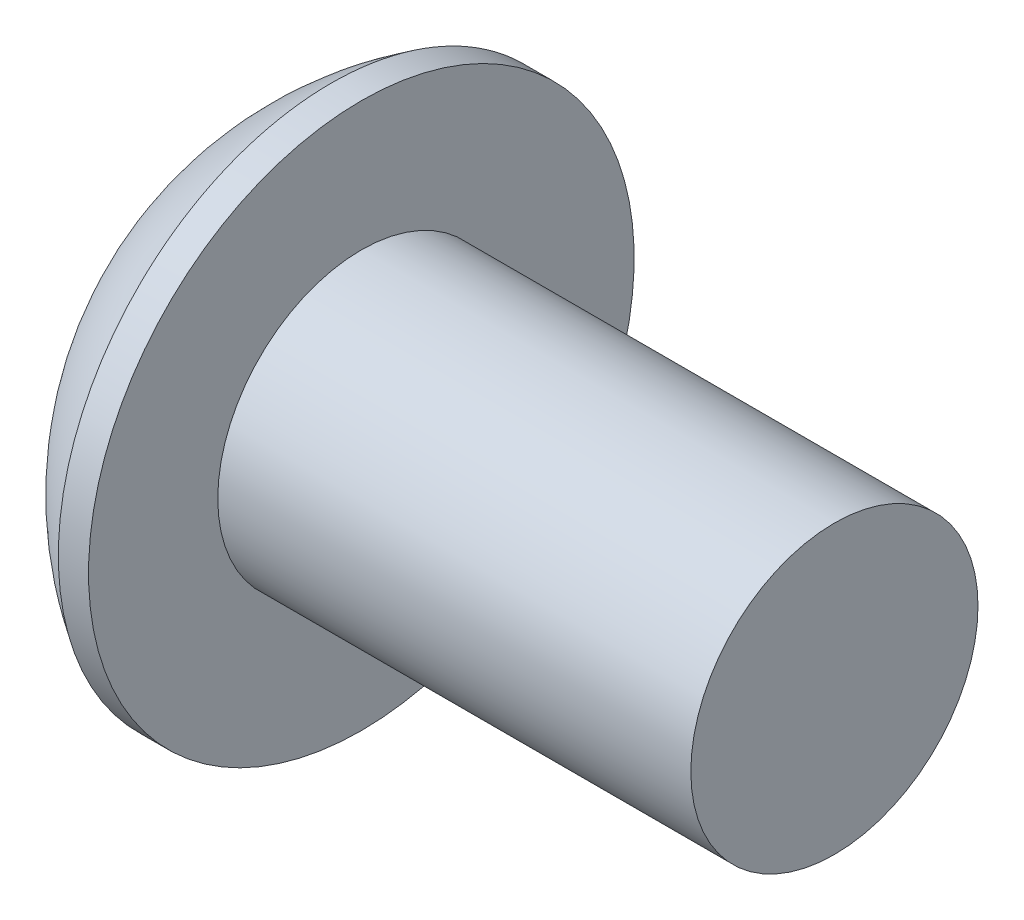
ISO-10303-21;
HEADER;
FILE_DESCRIPTION(('STEP AP214'),'2;1');
FILE_NAME('part.step','',(''),(''),'','','');
FILE_SCHEMA(('AUTOMOTIVE_DESIGN { 1 0 10303 214 1 1 1 1 }'));
ENDSEC;
DATA;
#1=APPLICATION_CONTEXT('core data for automotive mechanical design processes');
#2=APPLICATION_PROTOCOL_DEFINITION('international standard','automotive_design',2000,#1);
#3=PRODUCT_CONTEXT('',#1,'mechanical');
#4=PRODUCT('Part','Part','',(#3));
#5=PRODUCT_RELATED_PRODUCT_CATEGORY('part','',(#4));
#6=PRODUCT_DEFINITION_FORMATION('','',#4);
#7=PRODUCT_DEFINITION_CONTEXT('part definition',#1,'design');
#8=PRODUCT_DEFINITION('design','',#6,#7);
#9=PRODUCT_DEFINITION_SHAPE('','',#8);
#10=(LENGTH_UNIT() NAMED_UNIT(*) SI_UNIT(.MILLI.,.METRE.));
#11=(NAMED_UNIT(*) PLANE_ANGLE_UNIT() SI_UNIT($,.RADIAN.));
#12=(NAMED_UNIT(*) SI_UNIT($,.STERADIAN.) SOLID_ANGLE_UNIT());
#13=UNCERTAINTY_MEASURE_WITH_UNIT(LENGTH_MEASURE(1.E-05),#10,'distance_accuracy_value','');
#14=(GEOMETRIC_REPRESENTATION_CONTEXT(3) GLOBAL_UNCERTAINTY_ASSIGNED_CONTEXT((#13)) GLOBAL_UNIT_ASSIGNED_CONTEXT((#10,
#11,#12)) REPRESENTATION_CONTEXT('',''));
#15=CARTESIAN_POINT('',(0.,0.,0.));
#16=DIRECTION('',(0.,0.,1.));
#17=DIRECTION('',(1.,0.,0.));
#18=AXIS2_PLACEMENT_3D('',#15,#16,#17);
#19=CARTESIAN_POINT('',(-0.533400000000002,0.,0.));
#20=DIRECTION('',(-1.,0.,0.));
#21=DIRECTION('',(0.,0.,1.));
#22=AXIS2_PLACEMENT_3D('',#19,#20,#21);
#23=PLANE('',#22);
#24=DIRECTION('',(0.,0.5,0.866025403784439));
#25=VECTOR('',#24,1.);
#26=CARTESIAN_POINT('',(-0.533400000000002,1.83308710467706,0.));
#27=LINE('',#26,#25);
#28=CARTESIAN_POINT('',(-0.533400000000002,1.83308710467706,0.));
#29=VERTEX_POINT('',#28);
#30=CARTESIAN_POINT('',(-0.533400000000002,0.916543552338531,-1.5875));
#31=VERTEX_POINT('',#30);
#32=EDGE_CURVE('E114',#29,#31,#27,.F.);
#33=ORIENTED_EDGE('',*,*,#32,.T.);
#34=DIRECTION('',(0.,1.,0.));
#35=VECTOR('',#34,1.);
#36=CARTESIAN_POINT('',(-0.533400000000002,0.916543552338531,-1.5875));
#37=LINE('',#36,#35);
#38=CARTESIAN_POINT('',(-0.533400000000002,-0.916543552338531,-1.5875));
#39=VERTEX_POINT('',#38);
#40=EDGE_CURVE('E81',#31,#39,#37,.F.);
#41=ORIENTED_EDGE('',*,*,#40,.T.);
#42=DIRECTION('',(0.,0.5,-0.866025403784439));
#43=VECTOR('',#42,1.);
#44=CARTESIAN_POINT('',(-0.533400000000002,-0.916543552338531,-1.5875));
#45=LINE('',#44,#43);
#46=CARTESIAN_POINT('',(-0.533400000000002,-1.83308710467706,0.));
#47=VERTEX_POINT('',#46);
#48=EDGE_CURVE('E83',#39,#47,#45,.F.);
#49=ORIENTED_EDGE('',*,*,#48,.T.);
#50=DIRECTION('',(0.,-0.5,-0.866025403784439));
#51=VECTOR('',#50,1.);
#52=CARTESIAN_POINT('',(-0.533400000000002,-1.83308710467706,0.));
#53=LINE('',#52,#51);
#54=CARTESIAN_POINT('',(-0.533400000000002,-0.916543552338533,1.5875));
#55=VERTEX_POINT('',#54);
#56=EDGE_CURVE('E84',#47,#55,#53,.F.);
#57=ORIENTED_EDGE('',*,*,#56,.T.);
#58=DIRECTION('',(0.,-1.,0.));
#59=VECTOR('',#58,1.);
#60=CARTESIAN_POINT('',(-0.533400000000002,-0.916543552338532,1.5875));
#61=LINE('',#60,#59);
#62=CARTESIAN_POINT('',(-0.533400000000002,0.916543552338531,1.5875));
#63=VERTEX_POINT('',#62);
#64=EDGE_CURVE('E70',#55,#63,#61,.F.);
#65=ORIENTED_EDGE('',*,*,#64,.T.);
#66=DIRECTION('',(0.,-0.5,0.866025403784439));
#67=VECTOR('',#66,1.);
#68=CARTESIAN_POINT('',(-0.533400000000002,0.916543552338531,1.5875));
#69=LINE('',#68,#67);
#70=EDGE_CURVE('E109',#63,#29,#69,.F.);
#71=ORIENTED_EDGE('',*,*,#70,.T.);
#72=EDGE_LOOP('',(#33,#41,#49,#57,#65,#71));
#73=FACE_BOUND('',#72,.T.);
#74=ADVANCED_FACE('F16',(#73),#23,.T.);
#75=CARTESIAN_POINT('',(-0.533400000000002,-1.83308710467706,0.));
#76=DIRECTION('',(0.,-0.866025403784439,0.5));
#77=DIRECTION('',(0.,-0.5,-0.866025403784439));
#78=AXIS2_PLACEMENT_3D('',#75,#76,#77);
#79=PLANE('',#78);
#80=CARTESIAN_POINT('',(-2.56539999994394,-1.8330871046745,-2.00804498786736E-11));
#81=CARTESIAN_POINT('',(-2.53392818229741,-1.80158505518366,0.0545631502562923));
#82=CARTESIAN_POINT('',(-2.5043050627177,-1.76955629074211,0.110038597579172));
#83=CARTESIAN_POINT('',(-2.45006639539122,-1.70424635317817,0.223158727683824));
#84=CARTESIAN_POINT('',(-2.42548101615987,-1.6709589724711,0.280814162317604));
#85=CARTESIAN_POINT('',(-2.38336609605347,-1.60383660211837,0.397073518091736));
#86=CARTESIAN_POINT('',(-2.36573072948629,-1.57001869730198,0.455647847439699));
#87=CARTESIAN_POINT('',(-2.33856008862263,-1.50163859306838,0.574085662199493));
#88=CARTESIAN_POINT('',(-2.32900454007239,-1.46707848106388,0.633945532106421));
#89=CARTESIAN_POINT('',(-2.32038274183869,-1.40751253669323,0.737116774157155));
#90=CARTESIAN_POINT('',(-2.31910682172836,-1.38258360390154,0.780294952330845));
#91=CARTESIAN_POINT('',(-2.32125913780735,-1.33276652395073,0.866580665890379));
#92=CARTESIAN_POINT('',(-2.32468902284537,-1.30787839414808,0.90968817121394));
#93=CARTESIAN_POINT('',(-2.33605631415915,-1.25834345643267,0.995485200086784));
#94=CARTESIAN_POINT('',(-2.34399762019329,-1.23369687609494,1.03817432946455));
#95=CARTESIAN_POINT('',(-2.36395627681902,-1.18481740842653,1.12283605091316));
#96=CARTESIAN_POINT('',(-2.37597537628367,-1.16058470328902,1.16480832741616));
#97=CARTESIAN_POINT('',(-2.41164383187845,-1.09853862948576,1.27227527965358));
#98=CARTESIAN_POINT('',(-2.43797770752625,-1.06110942924036,1.33710455616529));
#99=CARTESIAN_POINT('',(-2.48243061452926,-1.00607390269188,1.43242888436855));
#100=CARTESIAN_POINT('',(-2.49804835924321,-0.987937988038022,1.46384120999077));
#101=CARTESIAN_POINT('',(-2.53070945051393,-0.951999508520197,1.52608848246242));
#102=CARTESIAN_POINT('',(-2.54775211871235,-0.934196789917587,1.55692369559499));
#103=CARTESIAN_POINT('',(-2.56539999993807,-0.916543552329633,1.58750000001541));
#104=B_SPLINE_CURVE_WITH_KNOTS('',3,(#80,#81,#82,#83,#84,#85,#86,#87,#88,#89,#90,#91,#92,#93,
#94,#95,#96,#97,#98,#99,#100,#101,#102,#103),.UNSPECIFIED.,.F.,.F.,(4,2,2,2,2,2,2,2,2,2,2,4),
(0.,0.211427927732169,0.424087197148228,0.633370156422424,0.842126401515785,0.991537201098734,
1.14100036552056,1.29059292577265,1.44024972414947,1.67781721417335,1.79627069411587,
1.91466809995991),.UNSPECIFIED.);
#105=CARTESIAN_POINT('',(-2.56539999993857,-1.83308710468646,0.));
#106=VERTEX_POINT('',#105);
#107=CARTESIAN_POINT('',(-2.56539999993106,-0.916543552342318,1.5875));
#108=VERTEX_POINT('',#107);
#109=EDGE_CURVE('E19',#106,#108,#104,.T.);
#110=ORIENTED_EDGE('',*,*,#109,.T.);
#111=DIRECTION('',(1.,0.,0.));
#112=VECTOR('',#111,1.);
#113=CARTESIAN_POINT('',(-0.533400000000002,-0.916543552338533,1.5875));
#114=LINE('',#113,#112);
#115=EDGE_CURVE('E89',#108,#55,#114,.T.);
#116=ORIENTED_EDGE('',*,*,#115,.T.);
#117=ORIENTED_EDGE('',*,*,#56,.F.);
#118=DIRECTION('',(1.,0.,0.));
#119=VECTOR('',#118,1.);
#120=CARTESIAN_POINT('',(-0.533400000000002,-1.83308710467706,0.));
#121=LINE('',#120,#119);
#122=EDGE_CURVE('E57',#47,#106,#121,.F.);
#123=ORIENTED_EDGE('',*,*,#122,.T.);
#124=EDGE_LOOP('',(#110,#116,#117,#123));
#125=FACE_BOUND('',#124,.T.);
#126=ADVANCED_FACE('F88',(#125),#79,.F.);
#127=CARTESIAN_POINT('',(-0.533400000000002,-0.916543552338531,-1.5875));
#128=DIRECTION('',(0.,-0.866025403784439,-0.5));
#129=DIRECTION('',(0.,0.5,-0.866025403784439));
#130=AXIS2_PLACEMENT_3D('',#127,#128,#129);
#131=PLANE('',#130);
#132=CARTESIAN_POINT('',(-2.56539999994527,-0.916543552319403,-1.58750000001409));
#133=CARTESIAN_POINT('',(-2.53392818229919,-0.948045601822691,-1.53293684974403));
#134=CARTESIAN_POINT('',(-2.50430506271949,-0.980074366269487,-1.47746140242354));
#135=CARTESIAN_POINT('',(-2.45006639539264,-1.04538430383757,-1.36434127232016));
#136=CARTESIAN_POINT('',(-2.42548101616093,-1.07867168454351,-1.30668583768523));
#137=CARTESIAN_POINT('',(-2.38336609605398,-1.14579405489574,-1.19042648190974));
#138=CARTESIAN_POINT('',(-2.36573072948662,-1.17961195971273,-1.13185215256154));
#139=CARTESIAN_POINT('',(-2.3385600886227,-1.2479920639471,-1.013414337801));
#140=CARTESIAN_POINT('',(-2.32900454007237,-1.28255217595175,-0.953554467893575));
#141=CARTESIAN_POINT('',(-2.32038274183866,-1.34211812032265,-0.850383225842316));
#142=CARTESIAN_POINT('',(-2.31910682172835,-1.36704705311438,-0.807205047668587));
#143=CARTESIAN_POINT('',(-2.32125913780739,-1.41686413306525,-0.720919334108961));
#144=CARTESIAN_POINT('',(-2.32468902284544,-1.44175226286793,-0.67781182878535));
#145=CARTESIAN_POINT('',(-2.33605631415929,-1.49128720058339,-0.592014799912417));
#146=CARTESIAN_POINT('',(-2.34399762019345,-1.51593378092113,-0.54932567053461));
#147=CARTESIAN_POINT('',(-2.36395627681926,-1.56481324858959,-0.464663949085931));
#148=CARTESIAN_POINT('',(-2.37597537628395,-1.58904595372712,-0.422691672582891));
#149=CARTESIAN_POINT('',(-2.41164383187876,-1.65109202753029,-0.315224720345625));
#150=CARTESIAN_POINT('',(-2.43797770752652,-1.6885212277756,-0.250395443834082));
#151=CARTESIAN_POINT('',(-2.48243061452944,-1.74355675432393,-0.15507111563107));
#152=CARTESIAN_POINT('',(-2.49804835924337,-1.76169266897775,-0.123658790008927));
#153=CARTESIAN_POINT('',(-2.53070945051401,-1.79763114849548,-0.0614115175374324));
#154=CARTESIAN_POINT('',(-2.5477521187124,-1.81543386709805,-0.0305763044049344));
#155=CARTESIAN_POINT('',(-2.56539999993807,-1.83308710468596,1.54136844652939E-11));
#156=B_SPLINE_CURVE_WITH_KNOTS('',3,(#132,#133,#134,#135,#136,#137,#138,#139,#140,#141,#142,
#143,#144,#145,#146,#147,#148,#149,#150,#151,#152,#153,#154,#155),.UNSPECIFIED.,.F.,.F.,(4,2,2,
2,2,2,2,2,2,2,2,4),(0.,0.211427927733669,0.424087197151313,0.633370156427101,0.842126401522016,
0.99153720110513,1.14100036552713,1.29059292577937,1.44024972415633,1.67781721417961,
1.79627069412184,1.9146680999656),.UNSPECIFIED.);
#157=CARTESIAN_POINT('',(-2.56539999995198,-0.916543552351339,-1.58750000002218));
#158=VERTEX_POINT('',#157);
#159=EDGE_CURVE('E93',#158,#106,#156,.T.);
#160=ORIENTED_EDGE('',*,*,#159,.T.);
#161=ORIENTED_EDGE('',*,*,#122,.F.);
#162=ORIENTED_EDGE('',*,*,#48,.F.);
#163=DIRECTION('',(-1.,0.,0.));
#164=VECTOR('',#163,1.);
#165=CARTESIAN_POINT('',(-0.533400000000002,-0.916543552338531,-1.5875));
#166=LINE('',#165,#164);
#167=EDGE_CURVE('E95',#39,#158,#166,.T.);
#168=ORIENTED_EDGE('',*,*,#167,.T.);
#169=EDGE_LOOP('',(#160,#161,#162,#168));
#170=FACE_BOUND('',#169,.T.);
#171=ADVANCED_FACE('F91',(#170),#131,.F.);
#172=CARTESIAN_POINT('',(-0.533400000000002,0.916543552338531,-1.5875));
#173=DIRECTION('',(0.,0.,-1.));
#174=DIRECTION('',(-1.,0.,0.));
#175=AXIS2_PLACEMENT_3D('',#172,#173,#174);
#176=PLANE('',#175);
#177=CARTESIAN_POINT('',(-2.56539999994527,0.916543552360294,-1.58749999999048));
#178=CARTESIAN_POINT('',(-2.53392818229821,0.853539453376781,-1.58749999999657));
#179=CARTESIAN_POINT('',(-2.50430506271702,0.789481924500113,-1.58749999999908));
#180=CARTESIAN_POINT('',(-2.45006639538581,0.658862049392287,-1.58750000000093));
#181=CARTESIAN_POINT('',(-2.42548101615122,0.59228728799181,-1.58750000000025));
#182=CARTESIAN_POINT('',(-2.38336609603683,0.458042547310979,-1.58749999999976));
#183=CARTESIAN_POINT('',(-2.36573072946494,0.390406737689213,-1.58749999999994));
#184=CARTESIAN_POINT('',(-2.3385600885904,0.253646529243895,-1.58750000000006));
#185=CARTESIAN_POINT('',(-2.32900454003397,0.184526305245804,-1.58750000000001));
#186=CARTESIAN_POINT('',(-2.32038274178942,0.0653944165301613,-1.58749999999999));
#187=CARTESIAN_POINT('',(-2.31910682167392,0.0155365509618711,-1.5875));
#188=CARTESIAN_POINT('',(-2.3212591377409,-0.0840976089101244,-1.5875));
#189=CARTESIAN_POINT('',(-2.32468902277208,-0.133873868500894,-1.5875));
#190=CARTESIAN_POINT('',(-2.33605631407098,-0.2329437439033,-1.5875));
#191=CARTESIAN_POINT('',(-2.34399762009707,-0.282236904564879,-1.5875));
#192=CARTESIAN_POINT('',(-2.36395627670599,-0.379995839874564,-1.5875));
#193=CARTESIAN_POINT('',(-2.37597537616188,-0.428461250136325,-1.5875));
#194=CARTESIAN_POINT('',(-2.41164383175616,-0.552553397787632,-1.5875));
#195=CARTESIAN_POINT('',(-2.43797770742117,-0.627411798334259,-1.5875));
#196=CARTESIAN_POINT('',(-2.48243061445881,-0.737482851511091,-1.5875));
#197=CARTESIAN_POINT('',(-2.49804835918582,-0.773754680844889,-1.5875));
#198=CARTESIAN_POINT('',(-2.53070945048496,-0.845631639931401,-1.5875));
#199=CARTESIAN_POINT('',(-2.54775211869874,-0.881237077161412,-1.5875));
#200=CARTESIAN_POINT('',(-2.56539999994071,-0.916543552361606,-1.5875));
#201=B_SPLINE_CURVE_WITH_KNOTS('',3,(#177,#178,#179,#180,#181,#182,#183,#184,#185,#186,#187,
#188,#189,#190,#191,#192,#193,#194,#195,#196,#197,#198,#199,#200),.UNSPECIFIED.,.F.,.F.,(4,2,2,
2,2,2,2,2,2,2,2,4),(0.,0.211427927701375,0.424087197086717,0.633370156331471,0.842126401395377,
0.991537200933545,1.14100036531054,1.29059292551773,1.44024972384963,1.677817214047,
1.79627069407681,1.91466810000777),.UNSPECIFIED.);
#202=CARTESIAN_POINT('',(-2.56539999995198,0.916543552337129,-1.58749999999757));
#203=VERTEX_POINT('',#202);
#204=EDGE_CURVE('E197',#203,#158,#201,.T.);
#205=ORIENTED_EDGE('',*,*,#204,.T.);
#206=ORIENTED_EDGE('',*,*,#167,.F.);
#207=ORIENTED_EDGE('',*,*,#40,.F.);
#208=DIRECTION('',(1.,0.,0.));
#209=VECTOR('',#208,1.);
#210=CARTESIAN_POINT('',(-0.533400000000002,0.916543552338531,-1.5875));
#211=LINE('',#210,#209);
#212=EDGE_CURVE('E111',#31,#203,#211,.F.);
#213=ORIENTED_EDGE('',*,*,#212,.T.);
#214=EDGE_LOOP('',(#205,#206,#207,#213));
#215=FACE_BOUND('',#214,.T.);
#216=ADVANCED_FACE('F187',(#215),#176,.F.);
#217=CARTESIAN_POINT('',(-0.533400000000002,1.83308710467706,0.));
#218=DIRECTION('',(0.,0.866025403784439,-0.5));
#219=DIRECTION('',(0.,0.5,0.866025403784439));
#220=AXIS2_PLACEMENT_3D('',#217,#218,#219);
#221=PLANE('',#220);
#222=CARTESIAN_POINT('',(-2.56539999994394,1.8330871046745,2.00800374309997E-11));
#223=CARTESIAN_POINT('',(-2.5339281822974,1.80158505518366,-0.0545631502562965));
#224=CARTESIAN_POINT('',(-2.5043050627177,1.76955629074211,-0.11003859757918));
#225=CARTESIAN_POINT('',(-2.45006639539121,1.70424635317816,-0.22315872768384));
#226=CARTESIAN_POINT('',(-2.42548101615987,1.67095897247109,-0.280814162317626));
#227=CARTESIAN_POINT('',(-2.38336609605347,1.60383660211835,-0.397073518091758));
#228=CARTESIAN_POINT('',(-2.36573072948628,1.57001869730197,-0.455647847439717));
#229=CARTESIAN_POINT('',(-2.33856008862263,1.50163859306837,-0.574085662199503));
#230=CARTESIAN_POINT('',(-2.32900454007239,1.46707848106388,-0.633945532106426));
#231=CARTESIAN_POINT('',(-2.32038274183869,1.40751253669322,-0.737116774157154));
#232=CARTESIAN_POINT('',(-2.31910682172836,1.38258360390154,-0.780294952330843));
#233=CARTESIAN_POINT('',(-2.32125913780735,1.33276652395073,-0.866580665890374));
#234=CARTESIAN_POINT('',(-2.32468902284537,1.30787839414808,-0.909688171213933));
#235=CARTESIAN_POINT('',(-2.33605631415915,1.25834345643267,-0.995485200086777));
#236=CARTESIAN_POINT('',(-2.34399762019328,1.23369687609495,-1.03817432946455));
#237=CARTESIAN_POINT('',(-2.36395627681902,1.18481740842653,-1.12283605091316));
#238=CARTESIAN_POINT('',(-2.37597537628367,1.16058470328902,-1.16480832741616));
#239=CARTESIAN_POINT('',(-2.41164383187872,1.09853862948529,-1.2722752796544));
#240=CARTESIAN_POINT('',(-2.43797770752691,1.06110942923942,-1.33710455616691));
#241=CARTESIAN_POINT('',(-2.48243061453059,1.00607390269029,-1.43242888437131));
#242=CARTESIAN_POINT('',(-2.49804835924479,0.987937988036214,-1.4638412099939));
#243=CARTESIAN_POINT('',(-2.53070945051602,0.951999508517968,-1.52608848246628));
#244=CARTESIAN_POINT('',(-2.54775211871471,0.934196789915152,-1.55692369559921));
#245=CARTESIAN_POINT('',(-2.56539999994071,0.916543552326994,-1.58750000001998));
#246=B_SPLINE_CURVE_WITH_KNOTS('',3,(#222,#223,#224,#225,#226,#227,#228,#229,#230,#231,#232,
#233,#234,#235,#236,#237,#238,#239,#240,#241,#242,#243,#244,#245),.UNSPECIFIED.,.F.,.F.,(4,2,2,
2,2,2,2,2,2,2,2,4),(0.,0.211427927732185,0.424087197148259,0.63337015642244,0.842126401515786,
0.99153720109873,1.14100036552055,1.29059292577265,1.44024972414947,1.67781721417631,
1.7962706941203,1.9146680999658),.UNSPECIFIED.);
#247=CARTESIAN_POINT('',(-2.56539999993857,1.83308710468646,0.));
#248=VERTEX_POINT('',#247);
#249=EDGE_CURVE('E191',#248,#203,#246,.T.);
#250=ORIENTED_EDGE('',*,*,#249,.T.);
#251=ORIENTED_EDGE('',*,*,#212,.F.);
#252=ORIENTED_EDGE('',*,*,#32,.F.);
#253=DIRECTION('',(1.,0.,0.));
#254=VECTOR('',#253,1.);
#255=CARTESIAN_POINT('',(-0.533400000000002,1.83308710467706,0.));
#256=LINE('',#255,#254);
#257=EDGE_CURVE('E106',#29,#248,#256,.F.);
#258=ORIENTED_EDGE('',*,*,#257,.T.);
#259=EDGE_LOOP('',(#250,#251,#252,#258));
#260=FACE_BOUND('',#259,.T.);
#261=ADVANCED_FACE('F183',(#260),#221,.F.);
#262=CARTESIAN_POINT('',(-0.533400000000002,0.916543552338531,1.5875));
#263=DIRECTION('',(0.,0.866025403784439,0.5));
#264=DIRECTION('',(0.,-0.5,0.866025403784439));
#265=AXIS2_PLACEMENT_3D('',#262,#263,#264);
#266=PLANE('',#265);
#267=CARTESIAN_POINT('',(-2.56539999994394,0.91654355231986,1.58750000000782));
#268=CARTESIAN_POINT('',(-2.53392818229741,0.948045601824288,1.5329368497393));
#269=CARTESIAN_POINT('',(-2.5043050627177,0.980074366271431,1.47746140241964));
#270=CARTESIAN_POINT('',(-2.45006639539122,1.04538430383949,1.36434127231737));
#271=CARTESIAN_POINT('',(-2.42548101615987,1.07867168454504,1.30668583768271));
#272=CARTESIAN_POINT('',(-2.38336609605347,1.14579405489669,1.19042648190795));
#273=CARTESIAN_POINT('',(-2.36573072948629,1.17961195971347,1.13185215256022));
#274=CARTESIAN_POINT('',(-2.33856008862263,1.24799206394736,1.01341433780059));
#275=CARTESIAN_POINT('',(-2.32900454007239,1.28255217595174,0.953554467893597));
#276=CARTESIAN_POINT('',(-2.32038274183869,1.34211812032234,0.850383225842832));
#277=CARTESIAN_POINT('',(-2.31910682172836,1.36704705311405,0.807205047669152));
#278=CARTESIAN_POINT('',(-2.32125913780735,1.41686413306487,0.720919334109624));
#279=CARTESIAN_POINT('',(-2.32468902284537,1.44175226286752,0.677811828786061));
#280=CARTESIAN_POINT('',(-2.33605631415915,1.49128720058292,0.592014799913215));
#281=CARTESIAN_POINT('',(-2.34399762019328,1.51593378092065,0.549325670535446));
#282=CARTESIAN_POINT('',(-2.36395627681902,1.56481324858906,0.464663949086841));
#283=CARTESIAN_POINT('',(-2.37597537628367,1.58904595372657,0.422691672583837));
#284=CARTESIAN_POINT('',(-2.41164383187845,1.65109202752983,0.315224720346425));
#285=CARTESIAN_POINT('',(-2.43797770752625,1.68852122777524,0.250395443834706));
#286=CARTESIAN_POINT('',(-2.48243061452926,1.74355675432371,0.155071115631445));
#287=CARTESIAN_POINT('',(-2.49804835924321,1.76169266897757,0.123658790009225));
#288=CARTESIAN_POINT('',(-2.53070945051393,1.7976311484954,0.0614115175375789));
#289=CARTESIAN_POINT('',(-2.54775211871235,1.81543386709801,0.0305763044050067));
#290=CARTESIAN_POINT('',(-2.56539999993807,1.83308710468596,-1.54142580803093E-11));
#291=B_SPLINE_CURVE_WITH_KNOTS('',3,(#267,#268,#269,#270,#271,#272,#273,#274,#275,#276,#277,
#278,#279,#280,#281,#282,#283,#284,#285,#286,#287,#288,#289,#290),.UNSPECIFIED.,.F.,.F.,(4,2,2,
2,2,2,2,2,2,2,2,4),(0.,0.211427927732169,0.424087197148227,0.633370156422423,0.842126401515785,
0.991537201098733,1.14100036552056,1.29059292577265,1.44024972414946,1.67781721417335,
1.79627069411587,1.91466809995991),.UNSPECIFIED.);
#292=CARTESIAN_POINT('',(-2.56539999993857,0.91654355234323,1.58750000000814));
#293=VERTEX_POINT('',#292);
#294=EDGE_CURVE('E165',#293,#248,#291,.T.);
#295=ORIENTED_EDGE('',*,*,#294,.T.);
#296=ORIENTED_EDGE('',*,*,#257,.F.);
#297=ORIENTED_EDGE('',*,*,#70,.F.);
#298=DIRECTION('',(1.,0.,0.));
#299=VECTOR('',#298,1.);
#300=CARTESIAN_POINT('',(-0.533400000000002,0.916543552338531,1.5875));
#301=LINE('',#300,#299);
#302=EDGE_CURVE('E38',#63,#293,#301,.F.);
#303=ORIENTED_EDGE('',*,*,#302,.T.);
#304=EDGE_LOOP('',(#295,#296,#297,#303));
#305=FACE_BOUND('',#304,.T.);
#306=ADVANCED_FACE('F176',(#305),#266,.F.);
#307=CARTESIAN_POINT('',(-0.533400000000002,-0.916543552338532,1.5875));
#308=DIRECTION('',(0.,0.,1.));
#309=DIRECTION('',(0.,-1.,0.));
#310=AXIS2_PLACEMENT_3D('',#307,#308,#309);
#311=PLANE('',#310);
#312=CARTESIAN_POINT('',(-2.56539999994394,-0.916543552354642,1.58749999998774));
#313=CARTESIAN_POINT('',(-2.53392818229741,-0.853539453359365,1.58749999999559));
#314=CARTESIAN_POINT('',(-2.50430506271771,-0.789481924470656,1.58749999999882));
#315=CARTESIAN_POINT('',(-2.45006639539122,-0.658862049338629,1.58750000000119));
#316=CARTESIAN_POINT('',(-2.42548101615988,-0.592287287925995,1.58750000000032));
#317=CARTESIAN_POINT('',(-2.38336609605349,-0.458042547221593,1.58749999999969));
#318=CARTESIAN_POINT('',(-2.36573072948631,-0.390406737588416,1.58749999999992));
#319=CARTESIAN_POINT('',(-2.33856008862266,-0.253646529120892,1.58750000000008));
#320=CARTESIAN_POINT('',(-2.32900454007243,-0.184526305112002,1.58750000000002));
#321=CARTESIAN_POINT('',(-2.32038274183874,-0.065394416370719,1.58749999999999));
#322=CARTESIAN_POINT('',(-2.31910682172841,-0.0155365507873145,1.5875));
#323=CARTESIAN_POINT('',(-2.32125913780742,0.0840976091143436,1.5875));
#324=CARTESIAN_POINT('',(-2.32468902284545,0.133873868719661,1.5875));
#325=CARTESIAN_POINT('',(-2.33605631415924,0.232943744150505,1.5875));
#326=CARTESIAN_POINT('',(-2.34399762019338,0.282236904825971,1.5875));
#327=CARTESIAN_POINT('',(-2.36395627681913,0.379995840162817,1.5875));
#328=CARTESIAN_POINT('',(-2.37597537628379,0.428461250437852,1.5875));
#329=CARTESIAN_POINT('',(-2.41164383187857,0.552553398044325,1.5875));
#330=CARTESIAN_POINT('',(-2.43797770752636,0.627411798535089,1.5875));
#331=CARTESIAN_POINT('',(-2.48243061452933,0.737482851631955,1.5875));
#332=CARTESIAN_POINT('',(-2.49804835924327,0.773754680939651,1.5875));
#333=CARTESIAN_POINT('',(-2.53070945051396,0.84563163997525,1.5875));
#334=CARTESIAN_POINT('',(-2.54775211871237,0.881237077180446,1.5875));
#335=CARTESIAN_POINT('',(-2.56539999993807,0.91654355235633,1.5875));
#336=B_SPLINE_CURVE_WITH_KNOTS('',3,(#312,#313,#314,#315,#316,#317,#318,#319,#320,#321,#322,
#323,#324,#325,#326,#327,#328,#329,#330,#331,#332,#333,#334,#335),.UNSPECIFIED.,.F.,.F.,(4,2,2,
2,2,2,2,2,2,2,2,4),(0.,0.211427927732202,0.424087197148294,0.633370156422521,0.842126401515914,
0.991537201098908,1.14100036552078,1.29059292577292,1.44024972414978,1.67781721417349,
1.79627069411592,1.91466809995988),.UNSPECIFIED.);
#337=EDGE_CURVE('E157',#108,#293,#336,.T.);
#338=ORIENTED_EDGE('',*,*,#337,.T.);
#339=ORIENTED_EDGE('',*,*,#302,.F.);
#340=ORIENTED_EDGE('',*,*,#64,.F.);
#341=ORIENTED_EDGE('',*,*,#115,.F.);
#342=EDGE_LOOP('',(#338,#339,#340,#341));
#343=FACE_BOUND('',#342,.T.);
#344=ADVANCED_FACE('F172',(#343),#311,.F.);
#345=CARTESIAN_POINT('',(-2.56540000003724,0.,0.));
#346=DIRECTION('',(-1.,0.,0.));
#347=DIRECTION('',(0.,-1.,0.));
#348=AXIS2_PLACEMENT_3D('',#345,#346,#347);
#349=CONICAL_SURFACE('',#348,1.83308710478514,0.78539816351237);
#350=ORIENTED_EDGE('',*,*,#109,.F.);
#351=CARTESIAN_POINT('',(-2.56539999992356,0.,0.));
#352=DIRECTION('',(-1.,0.,0.));
#353=DIRECTION('',(0.,-1.,0.));
#354=AXIS2_PLACEMENT_3D('',#351,#352,#353);
#355=CIRCLE('',#354,1.83308710467145);
#356=EDGE_CURVE('E164',#108,#106,#355,.F.);
#357=ORIENTED_EDGE('',*,*,#356,.F.);
#358=EDGE_LOOP('',(#350,#357));
#359=FACE_BOUND('',#358,.T.);
#360=ADVANCED_FACE('F175',(#359),#349,.F.);
#361=CARTESIAN_POINT('',(-2.56540000003724,0.,0.));
#362=DIRECTION('',(-1.,0.,0.));
#363=DIRECTION('',(0.,-1.,0.));
#364=AXIS2_PLACEMENT_3D('',#361,#362,#363);
#365=CONICAL_SURFACE('',#364,1.83308710478514,0.78539816351237);
#366=ORIENTED_EDGE('',*,*,#159,.F.);
#367=CARTESIAN_POINT('',(-2.56539999992356,0.,0.));
#368=DIRECTION('',(-1.,0.,0.));
#369=DIRECTION('',(0.,-1.,0.));
#370=AXIS2_PLACEMENT_3D('',#367,#368,#369);
#371=CIRCLE('',#370,1.83308710467145);
#372=EDGE_CURVE('E271',#106,#158,#371,.F.);
#373=ORIENTED_EDGE('',*,*,#372,.F.);
#374=EDGE_LOOP('',(#366,#373));
#375=FACE_BOUND('',#374,.T.);
#376=ADVANCED_FACE('F209',(#375),#365,.F.);
#377=CARTESIAN_POINT('',(-2.56540000003724,0.,0.));
#378=DIRECTION('',(-1.,0.,0.));
#379=DIRECTION('',(0.,-1.,0.));
#380=AXIS2_PLACEMENT_3D('',#377,#378,#379);
#381=CONICAL_SURFACE('',#380,1.83308710478514,0.785398163397448);
#382=ORIENTED_EDGE('',*,*,#204,.F.);
#383=CARTESIAN_POINT('',(-2.5653999999804,0.,0.));
#384=DIRECTION('',(-1.,0.,0.));
#385=DIRECTION('',(0.,-1.,0.));
#386=AXIS2_PLACEMENT_3D('',#383,#384,#385);
#387=CIRCLE('',#386,1.83308710472829);
#388=EDGE_CURVE('E268',#158,#203,#387,.F.);
#389=ORIENTED_EDGE('',*,*,#388,.F.);
#390=EDGE_LOOP('',(#382,#389));
#391=FACE_BOUND('',#390,.T.);
#392=ADVANCED_FACE('F205',(#391),#381,.F.);
#393=CARTESIAN_POINT('',(-2.56540000003724,0.,0.));
#394=DIRECTION('',(-1.,0.,0.));
#395=DIRECTION('',(0.,-1.,0.));
#396=AXIS2_PLACEMENT_3D('',#393,#394,#395);
#397=CONICAL_SURFACE('',#396,1.83308710478514,0.78539816351237);
#398=ORIENTED_EDGE('',*,*,#249,.F.);
#399=CARTESIAN_POINT('',(-2.56539999992356,0.,0.));
#400=DIRECTION('',(-1.,0.,0.));
#401=DIRECTION('',(0.,-1.,0.));
#402=AXIS2_PLACEMENT_3D('',#399,#400,#401);
#403=CIRCLE('',#402,1.83308710467145);
#404=EDGE_CURVE('E265',#203,#248,#403,.F.);
#405=ORIENTED_EDGE('',*,*,#404,.F.);
#406=EDGE_LOOP('',(#398,#405));
#407=FACE_BOUND('',#406,.T.);
#408=ADVANCED_FACE('F202',(#407),#397,.F.);
#409=CARTESIAN_POINT('',(-2.56540000003724,0.,0.));
#410=DIRECTION('',(-1.,0.,0.));
#411=DIRECTION('',(0.,-1.,0.));
#412=AXIS2_PLACEMENT_3D('',#409,#410,#411);
#413=CONICAL_SURFACE('',#412,1.83308710478514,0.78539816351237);
#414=ORIENTED_EDGE('',*,*,#294,.F.);
#415=CARTESIAN_POINT('',(-2.56539999992356,0.,0.));
#416=DIRECTION('',(-1.,0.,0.));
#417=DIRECTION('',(0.,-1.,0.));
#418=AXIS2_PLACEMENT_3D('',#415,#416,#417);
#419=CIRCLE('',#418,1.83308710467145);
#420=EDGE_CURVE('E260',#248,#293,#419,.F.);
#421=ORIENTED_EDGE('',*,*,#420,.F.);
#422=EDGE_LOOP('',(#414,#421));
#423=FACE_BOUND('',#422,.T.);
#424=ADVANCED_FACE('F152',(#423),#413,.F.);
#425=CARTESIAN_POINT('',(-2.56540000003724,0.,0.));
#426=DIRECTION('',(-1.,0.,0.));
#427=DIRECTION('',(0.,-1.,0.));
#428=AXIS2_PLACEMENT_3D('',#425,#426,#427);
#429=CONICAL_SURFACE('',#428,1.83308710478514,0.785398163512485);
#430=ORIENTED_EDGE('',*,*,#337,.F.);
#431=CARTESIAN_POINT('',(-2.56539999992356,0.,0.));
#432=DIRECTION('',(-1.,0.,0.));
#433=DIRECTION('',(0.,-1.,0.));
#434=AXIS2_PLACEMENT_3D('',#431,#432,#433);
#435=CIRCLE('',#434,1.83308710467145);
#436=EDGE_CURVE('E137',#293,#108,#435,.F.);
#437=ORIENTED_EDGE('',*,*,#436,.F.);
#438=EDGE_LOOP('',(#430,#437));
#439=FACE_BOUND('',#438,.T.);
#440=ADVANCED_FACE('F147',(#439),#429,.F.);
#441=CARTESIAN_POINT('',(-2.5654,0.,0.));
#442=DIRECTION('',(-1.,0.,0.));
#443=DIRECTION('',(0.,-1.,0.));
#444=AXIS2_PLACEMENT_3D('',#441,#442,#443);
#445=PLANE('',#444);
#446=CARTESIAN_POINT('',(-2.5654,-2.29235000000002,0.));
#447=CARTESIAN_POINT('',(-2.56540000000001,-2.29234961429958,-0.0643619991867162));
#448=CARTESIAN_POINT('',(-2.56540000000002,-2.28963695190109,-0.128735826629366));
#449=CARTESIAN_POINT('',(-2.56539999999999,-2.27880393843649,-0.257038618985287));
#450=CARTESIAN_POINT('',(-2.56539999999995,-2.27068199085128,-0.320967446929163));
#451=CARTESIAN_POINT('',(-2.56540000000006,-2.24906694794257,-0.448021254607718));
#452=CARTESIAN_POINT('',(-2.56540000000021,-2.23556532653462,-0.511144793381861));
#453=CARTESIAN_POINT('',(-2.56539999999979,-2.20328400495645,-0.636065176149322));
#454=CARTESIAN_POINT('',(-2.56539999999921,-2.18450002159115,-0.697860899533935));
#455=CARTESIAN_POINT('',(-2.56539999999869,-2.12048422735804,-0.88032980292775));
#456=CARTESIAN_POINT('',(-2.56539999999995,-2.0675359907946,-0.99839179592812));
#457=CARTESIAN_POINT('',(-2.56540000000006,-1.94254204858674,-1.22393765942148));
#458=CARTESIAN_POINT('',(-2.56539999999891,-1.87049561696644,-1.33142112758208));
#459=CARTESIAN_POINT('',(-2.56539999999932,-1.74974254194881,-1.48237719670935));
#460=CARTESIAN_POINT('',(-2.56539999999982,-1.70734573132302,-1.53101280076738));
#461=CARTESIAN_POINT('',(-2.56540000000018,-1.6186391029153,-1.62450601319185));
#462=CARTESIAN_POINT('',(-2.56540000000005,-1.57233309727313,-1.66936721890417));
#463=CARTESIAN_POINT('',(-2.56539999999995,-1.47608431707234,-1.7550488420402));
#464=CARTESIAN_POINT('',(-2.56539999999999,-1.42613990458995,-1.79586741981512));
#465=CARTESIAN_POINT('',(-2.56540000000002,-1.32299452541252,-1.87315615311523));
#466=CARTESIAN_POINT('',(-2.56540000000001,-1.26979280714188,-1.90962529930697));
#467=CARTESIAN_POINT('',(-2.56539999999999,-1.10588180153953,-2.0120772215109));
#468=CARTESIAN_POINT('',(-2.5654,-0.990764947001321,-2.07119486286667));
#469=CARTESIAN_POINT('',(-2.5654,-0.752302198839727,-2.16922858468856));
#470=CARTESIAN_POINT('',(-2.5654,-0.628956393121269,-2.2081448809145));
#471=CARTESIAN_POINT('',(-2.5654,-0.377466101733277,-2.2647275576592));
#472=CARTESIAN_POINT('',(-2.5654,-0.249321590440388,-2.28239382469379));
#473=CARTESIAN_POINT('',(-2.5654,0.0081143537161001,-2.29595665980956));
#474=CARTESIAN_POINT('',(-2.5654,0.137405786579698,-2.29185322789073));
#475=CARTESIAN_POINT('',(-2.5654,0.393449386933719,-2.2620096240906));
#476=CARTESIAN_POINT('',(-2.5654,0.520201567981077,-2.23626956775766));
#477=CARTESIAN_POINT('',(-2.5654,0.767645294384444,-2.16383549332687));
#478=CARTESIAN_POINT('',(-2.5654,0.888336774993549,-2.11714125142686));
#479=CARTESIAN_POINT('',(-2.5654,1.06210572146655,-2.03247976453654));
#480=CARTESIAN_POINT('',(-2.5654,1.11884498714066,-2.00180278323696));
#481=CARTESIAN_POINT('',(-2.5654,1.22954062855572,-1.93578011658036));
#482=CARTESIAN_POINT('',(-2.5654,1.28349764565392,-1.9004355139425));
#483=CARTESIAN_POINT('',(-2.5654,1.38821676641537,-1.82534174602348));
#484=CARTESIAN_POINT('',(-2.5654,1.43898030563028,-1.78559458231503));
#485=CARTESIAN_POINT('',(-2.5654,1.53701984534431,-1.70193996292362));
#486=CARTESIAN_POINT('',(-2.5654,1.5842924328055,-1.65802852924127));
#487=CARTESIAN_POINT('',(-2.5654,1.72023903553758,-1.52059650554139));
#488=CARTESIAN_POINT('',(-2.5654,1.80318066138239,-1.42127847626519));
#489=CARTESIAN_POINT('',(-2.5654,1.95118232345098,-1.21011519784664));
#490=CARTESIAN_POINT('',(-2.5654,2.01624303935584,-1.09827042509272));
#491=CARTESIAN_POINT('',(-2.5654,2.09907772661314,-0.923538238005839));
#492=CARTESIAN_POINT('',(-2.5654,2.12425103063558,-0.864058373981966));
#493=CARTESIAN_POINT('',(-2.5654,2.16947990046565,-0.743221562175601));
#494=CARTESIAN_POINT('',(-2.5654,2.18953960800684,-0.681866178863365));
#495=CARTESIAN_POINT('',(-2.5654,2.22438542051156,-0.557786972400356));
#496=CARTESIAN_POINT('',(-2.5654,2.23917985294818,-0.495065478128172));
#497=CARTESIAN_POINT('',(-2.5654,2.26343456384453,-0.368611258323514));
#498=CARTESIAN_POINT('',(-2.5654,2.27289641559285,-0.304878836759566));
#499=CARTESIAN_POINT('',(-2.5654,2.28388649696736,-0.200873029360621));
#500=CARTESIAN_POINT('',(-2.5654,2.28705930623293,-0.160766164180096));
#501=CARTESIAN_POINT('',(-2.5654,2.29129117827044,-0.0804410725432706));
#502=CARTESIAN_POINT('',(-2.5654,2.29235024104238,-0.0402228460869715));
#503=CARTESIAN_POINT('',(-2.56540000000001,2.29234961429956,0.0643619991867166));
#504=CARTESIAN_POINT('',(-2.56540000000002,2.28963695190107,0.128735826629366));
#505=CARTESIAN_POINT('',(-2.56539999999999,2.27880393843648,0.257038618985288));
#506=CARTESIAN_POINT('',(-2.56539999999995,2.27068199085126,0.320967446929163));
#507=CARTESIAN_POINT('',(-2.56540000000006,2.24906694794255,0.448021254607719));
#508=CARTESIAN_POINT('',(-2.56540000000021,2.2355653265346,0.511144793381862));
#509=CARTESIAN_POINT('',(-2.56539999999979,2.20328400495644,0.636065176149322));
#510=CARTESIAN_POINT('',(-2.56539999999921,2.18450002159113,0.697860899533936));
#511=CARTESIAN_POINT('',(-2.56539999999869,2.12048422735802,0.88032980292775));
#512=CARTESIAN_POINT('',(-2.56539999999995,2.06753599079459,0.998391795928119));
#513=CARTESIAN_POINT('',(-2.56540000000006,1.94254204858672,1.22393765942147));
#514=CARTESIAN_POINT('',(-2.56539999999891,1.87049561696642,1.33142112758208));
#515=CARTESIAN_POINT('',(-2.56539999999933,1.7497425419488,1.48237719670935));
#516=CARTESIAN_POINT('',(-2.56539999999982,1.707345731323,1.53101280076738));
#517=CARTESIAN_POINT('',(-2.56540000000018,1.61863910291529,1.62450601319185));
#518=CARTESIAN_POINT('',(-2.56540000000005,1.57233309727312,1.66936721890418));
#519=CARTESIAN_POINT('',(-2.56539999999995,1.47608431707233,1.75504884204021));
#520=CARTESIAN_POINT('',(-2.56539999999999,1.42613990458993,1.79586741981512));
#521=CARTESIAN_POINT('',(-2.56540000000002,1.3229945254125,1.87315615311523));
#522=CARTESIAN_POINT('',(-2.56540000000001,1.26979280714187,1.90962529930697));
#523=CARTESIAN_POINT('',(-2.56539999999999,1.10588180153952,2.0120772215109));
#524=CARTESIAN_POINT('',(-2.5654,0.990764947001304,2.07119486286667));
#525=CARTESIAN_POINT('',(-2.5654,0.75230219883971,2.16922858468856));
#526=CARTESIAN_POINT('',(-2.5654,0.628956393121252,2.2081448809145));
#527=CARTESIAN_POINT('',(-2.5654,0.377466101733262,2.2647275576592));
#528=CARTESIAN_POINT('',(-2.5654,0.249321590440372,2.28239382469379));
#529=CARTESIAN_POINT('',(-2.5654,-0.00811435371611611,2.29595665980955));
#530=CARTESIAN_POINT('',(-2.5654,-0.137405786579714,2.29185322789072));
#531=CARTESIAN_POINT('',(-2.5654,-0.393449386933735,2.2620096240906));
#532=CARTESIAN_POINT('',(-2.5654,-0.520201567981094,2.23626956775766));
#533=CARTESIAN_POINT('',(-2.5654,-0.767645294384462,2.16383549332688));
#534=CARTESIAN_POINT('',(-2.5654,-0.888336774993567,2.11714125142686));
#535=CARTESIAN_POINT('',(-2.5654,-1.06210572146657,2.03247976453654));
#536=CARTESIAN_POINT('',(-2.5654,-1.11884498714068,2.00180278323695));
#537=CARTESIAN_POINT('',(-2.5654,-1.22954062855574,1.93578011658036));
#538=CARTESIAN_POINT('',(-2.5654,-1.28349764565394,1.9004355139425));
#539=CARTESIAN_POINT('',(-2.5654,-1.38821676641539,1.82534174602348));
#540=CARTESIAN_POINT('',(-2.5654,-1.4389803056303,1.78559458231503));
#541=CARTESIAN_POINT('',(-2.5654,-1.53701984534432,1.70193996292362));
#542=CARTESIAN_POINT('',(-2.5654,-1.58429243280552,1.65802852924127));
#543=CARTESIAN_POINT('',(-2.5654,-1.7202390355376,1.52059650554139));
#544=CARTESIAN_POINT('',(-2.5654,-1.8031806613824,1.42127847626519));
#545=CARTESIAN_POINT('',(-2.5654,-1.951182323451,1.21011519784664));
#546=CARTESIAN_POINT('',(-2.5654,-2.01624303935586,1.09827042509272));
#547=CARTESIAN_POINT('',(-2.5654,-2.09907772661316,0.923538238005837));
#548=CARTESIAN_POINT('',(-2.5654,-2.1242510306356,0.864058373981964));
#549=CARTESIAN_POINT('',(-2.5654,-2.16947990046567,0.743221562175599));
#550=CARTESIAN_POINT('',(-2.5654,-2.18953960800686,0.681866178863365));
#551=CARTESIAN_POINT('',(-2.5654,-2.22438542051158,0.557786972400357));
#552=CARTESIAN_POINT('',(-2.5654,-2.2391798529482,0.495065478128172));
#553=CARTESIAN_POINT('',(-2.5654,-2.26343456384455,0.368611258323514));
#554=CARTESIAN_POINT('',(-2.5654,-2.27289641559287,0.304878836759567));
#555=CARTESIAN_POINT('',(-2.5654,-2.28388649696738,0.200873029360623));
#556=CARTESIAN_POINT('',(-2.5654,-2.28705930623295,0.160766164180096));
#557=CARTESIAN_POINT('',(-2.5654,-2.29129117827046,0.080441072543271));
#558=CARTESIAN_POINT('',(-2.5654,-2.29235024104239,0.0402228460869719));
#559=CARTESIAN_POINT('',(-2.5654,-2.29235000000002,0.));
#560=B_SPLINE_CURVE_WITH_KNOTS('',3,(#446,#447,#448,#449,#450,#451,#452,#453,#454,#455,#456,
#457,#458,#459,#460,#461,#462,#463,#464,#465,#466,#467,#468,#469,#470,#471,#472,#473,#474,#475,
#476,#477,#478,#479,#480,#481,#482,#483,#484,#485,#486,#487,#488,#489,#490,#491,#492,#493,#494,
#495,#496,#497,#498,#499,#500,#501,#502,#503,#504,#505,#506,#507,#508,#509,#510,#511,#512,#513,
#514,#515,#516,#517,#518,#519,#520,#521,#522,#523,#524,#525,#526,#527,#528,#529,#530,#531,#532,
#533,#534,#535,#536,#537,#538,#539,#540,#541,#542,#543,#544,#545,#546,#547,#548,#549,#550,#551,
#552,#553,#554,#555,#556,#557,#558,#559),.UNSPECIFIED.,.T.,.F.,(4,2,2,2,2,2,2,2,2,2,2,2,2,2,2,2,
2,2,2,2,2,2,2,2,2,2,2,2,2,2,2,2,2,2,2,2,2,2,2,2,2,2,2,2,2,2,2,2,2,2,2,2,2,2,2,2,4),(0.,
0.193048968618034,0.386154939782395,0.579568183995959,0.77313871149104,1.15935703864578,
1.54559004914645,1.73895960916369,1.93214273180064,2.12541336477222,2.31872876140889,
2.70495649282619,3.09118009906583,3.47740576789432,3.86363143672286,4.24985504296255,
4.6360827743798,4.82939817101621,5.02266880398749,5.21585192662421,5.40922148664123,
5.79545449714218,6.18167282429725,6.37524335179263,6.56865659600643,6.7617625671709,
6.9548115357891,7.07545693291923,7.19610233004938,7.38915129866742,7.58225726983178,
7.77567051404534,7.96924104154042,8.35545936869516,8.74169237919583,8.93506193921307,
9.12824506185002,9.3215156948216,9.51483109145827,9.90105882287557,10.2872824291152,
10.6735080979437,11.0597337667722,11.4459573730119,11.8321851044292,12.0255005010656,
12.2187711340369,12.4119542566736,12.6053238166906,12.9915568271916,13.3777751543466,
13.571345681842,13.7647589260558,13.9578648972203,14.1509138658385,14.2715592629686,
14.3922046600988),.UNSPECIFIED.);
#561=CARTESIAN_POINT('',(-2.5654,-2.29235000000002,0.));
#562=VERTEX_POINT('',#561);
#563=EDGE_CURVE('E130',#562,#562,#560,.T.);
#564=ORIENTED_EDGE('',*,*,#563,.F.);
#565=EDGE_LOOP('',(#564));
#566=FACE_BOUND('',#565,.T.);
#567=ORIENTED_EDGE('',*,*,#420,.T.);
#568=ORIENTED_EDGE('',*,*,#436,.T.);
#569=ORIENTED_EDGE('',*,*,#356,.T.);
#570=ORIENTED_EDGE('',*,*,#372,.T.);
#571=ORIENTED_EDGE('',*,*,#388,.T.);
#572=ORIENTED_EDGE('',*,*,#404,.T.);
#573=EDGE_LOOP('',(#567,#568,#569,#570,#571,#572));
#574=FACE_BOUND('',#573,.T.);
#575=ADVANCED_FACE('F143',(#566,#574),#445,.T.);
#576=CARTESIAN_POINT('',(2.29449606481481,0.,0.));
#577=DIRECTION('',(0.,1.,0.));
#578=DIRECTION('',(-1.,0.,0.));
#579=AXIS2_PLACEMENT_3D('',#576,#577,#578);
#580=SPHERICAL_SURFACE('',#579,5.37340285883187);
#581=ORIENTED_EDGE('',*,*,#563,.T.);
#582=EDGE_LOOP('',(#581));
#583=FACE_BOUND('',#582,.T.);
#584=CARTESIAN_POINT('',(-0.508,0.,0.));
#585=DIRECTION('',(1.,0.,0.));
#586=DIRECTION('',(0.,1.,0.));
#587=AXIS2_PLACEMENT_3D('',#584,#585,#586);
#588=CIRCLE('',#587,4.5847);
#589=CARTESIAN_POINT('',(-0.508,4.5847,0.));
#590=VERTEX_POINT('',#589);
#591=EDGE_CURVE('E127',#590,#590,#588,.T.);
#592=ORIENTED_EDGE('',*,*,#591,.F.);
#593=EDGE_LOOP('',(#592));
#594=FACE_BOUND('',#593,.T.);
#595=ADVANCED_FACE('F139',(#583,#594),#580,.T.);
#596=CARTESIAN_POINT('',(0.,0.,0.));
#597=DIRECTION('',(1.,0.,0.));
#598=DIRECTION('',(0.,1.,0.));
#599=AXIS2_PLACEMENT_3D('',#596,#597,#598);
#600=CYLINDRICAL_SURFACE('',#599,4.5847);
#601=ORIENTED_EDGE('',*,*,#591,.T.);
#602=EDGE_LOOP('',(#601));
#603=FACE_BOUND('',#602,.T.);
#604=CARTESIAN_POINT('',(0.,0.,0.));
#605=DIRECTION('',(1.,0.,0.));
#606=DIRECTION('',(0.,1.,0.));
#607=AXIS2_PLACEMENT_3D('',#604,#605,#606);
#608=CIRCLE('',#607,4.5847);
#609=CARTESIAN_POINT('',(0.,4.5847,0.));
#610=VERTEX_POINT('',#609);
#611=EDGE_CURVE('E124',#610,#610,#608,.T.);
#612=ORIENTED_EDGE('',*,*,#611,.F.);
#613=EDGE_LOOP('',(#612));
#614=FACE_BOUND('',#613,.T.);
#615=ADVANCED_FACE('F239',(#603,#614),#600,.T.);
#616=CARTESIAN_POINT('',(7.9502,0.,0.));
#617=DIRECTION('',(1.,0.,0.));
#618=DIRECTION('',(0.,1.,0.));
#619=AXIS2_PLACEMENT_3D('',#616,#617,#618);
#620=PLANE('',#619);
#621=CARTESIAN_POINT('',(7.9502,0.,0.));
#622=DIRECTION('',(-1.,0.,0.));
#623=DIRECTION('',(0.,-1.,0.));
#624=AXIS2_PLACEMENT_3D('',#621,#622,#623);
#625=CIRCLE('',#624,2.413);
#626=CARTESIAN_POINT('',(7.9502,-2.413,0.));
#627=VERTEX_POINT('',#626);
#628=EDGE_CURVE('E29',#627,#627,#625,.T.);
#629=ORIENTED_EDGE('',*,*,#628,.F.);
#630=EDGE_LOOP('',(#629));
#631=FACE_BOUND('',#630,.T.);
#632=ADVANCED_FACE('F233',(#631),#620,.T.);
#633=CARTESIAN_POINT('',(0.,4.5847,0.));
#634=DIRECTION('',(1.,0.,0.));
#635=DIRECTION('',(0.,1.,0.));
#636=AXIS2_PLACEMENT_3D('',#633,#634,#635);
#637=PLANE('',#636);
#638=CARTESIAN_POINT('',(0.,0.,0.));
#639=DIRECTION('',(-1.,0.,0.));
#640=DIRECTION('',(0.,-1.,0.));
#641=AXIS2_PLACEMENT_3D('',#638,#639,#640);
#642=CIRCLE('',#641,2.413);
#643=CARTESIAN_POINT('',(0.,-2.413,0.));
#644=VERTEX_POINT('',#643);
#645=EDGE_CURVE('E11',#644,#644,#642,.F.);
#646=ORIENTED_EDGE('',*,*,#645,.F.);
#647=EDGE_LOOP('',(#646));
#648=FACE_BOUND('',#647,.T.);
#649=ORIENTED_EDGE('',*,*,#611,.T.);
#650=EDGE_LOOP('',(#649));
#651=FACE_BOUND('',#650,.T.);
#652=ADVANCED_FACE('F227',(#648,#651),#637,.T.);
#653=CARTESIAN_POINT('',(7.9502,0.,0.));
#654=DIRECTION('',(-1.,0.,0.));
#655=DIRECTION('',(0.,-1.,0.));
#656=AXIS2_PLACEMENT_3D('',#653,#654,#655);
#657=CYLINDRICAL_SURFACE('',#656,2.413);
#658=ORIENTED_EDGE('',*,*,#628,.T.);
#659=EDGE_LOOP('',(#658));
#660=FACE_BOUND('',#659,.T.);
#661=ORIENTED_EDGE('',*,*,#645,.T.);
#662=EDGE_LOOP('',(#661));
#663=FACE_BOUND('',#662,.T.);
#664=ADVANCED_FACE('F225',(#660,#663),#657,.T.);
#665=CLOSED_SHELL('',(#74,#126,#171,#216,#261,#306,#344,#360,#376,#392,#408,#424,#440,#575,#595,
#615,#632,#652,#664));
#666=MANIFOLD_SOLID_BREP('B1',#665);
#667=ADVANCED_BREP_SHAPE_REPRESENTATION('',(#18,#666),#14);
#668=SHAPE_DEFINITION_REPRESENTATION(#9,#667);
ENDSEC;
END-ISO-10303-21;
